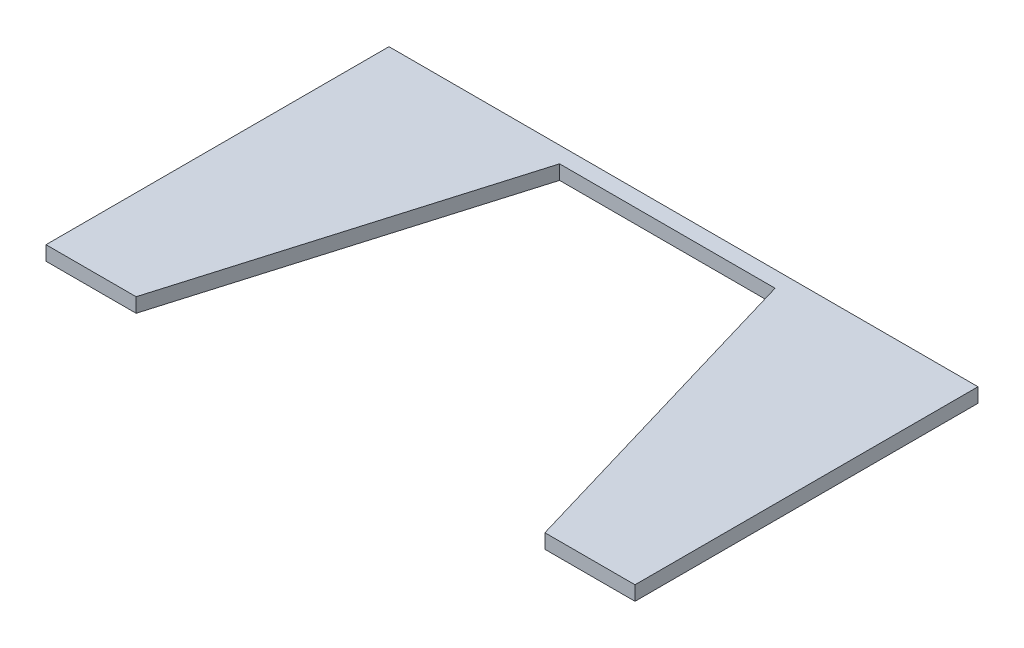
ISO-10303-21;
HEADER;
FILE_DESCRIPTION(('STEP AP214'),'2;1');
FILE_NAME('part.step','',(''),(''),'','','');
FILE_SCHEMA(('AUTOMOTIVE_DESIGN { 1 0 10303 214 1 1 1 1 }'));
ENDSEC;
DATA;
#1=APPLICATION_CONTEXT('core data for automotive mechanical design processes');
#2=APPLICATION_PROTOCOL_DEFINITION('international standard','automotive_design',2000,#1);
#3=PRODUCT_CONTEXT('',#1,'mechanical');
#4=PRODUCT('Part','Part','',(#3));
#5=PRODUCT_RELATED_PRODUCT_CATEGORY('part','',(#4));
#6=PRODUCT_DEFINITION_FORMATION('','',#4);
#7=PRODUCT_DEFINITION_CONTEXT('part definition',#1,'design');
#8=PRODUCT_DEFINITION('design','',#6,#7);
#9=PRODUCT_DEFINITION_SHAPE('','',#8);
#10=(LENGTH_UNIT() NAMED_UNIT(*) SI_UNIT(.MILLI.,.METRE.));
#11=(NAMED_UNIT(*) PLANE_ANGLE_UNIT() SI_UNIT($,.RADIAN.));
#12=(NAMED_UNIT(*) SI_UNIT($,.STERADIAN.) SOLID_ANGLE_UNIT());
#13=UNCERTAINTY_MEASURE_WITH_UNIT(LENGTH_MEASURE(1.E-05),#10,'distance_accuracy_value','');
#14=(GEOMETRIC_REPRESENTATION_CONTEXT(3) GLOBAL_UNCERTAINTY_ASSIGNED_CONTEXT((#13)) GLOBAL_UNIT_ASSIGNED_CONTEXT((#10,
#11,#12)) REPRESENTATION_CONTEXT('',''));
#15=CARTESIAN_POINT('',(0.,0.,0.));
#16=DIRECTION('',(0.,0.,1.));
#17=DIRECTION('',(1.,0.,0.));
#18=AXIS2_PLACEMENT_3D('',#15,#16,#17);
#19=CARTESIAN_POINT('',(0.,4.,-1.00000000000005));
#20=DIRECTION('',(0.,0.,1.));
#21=DIRECTION('',(1.,0.,0.));
#22=AXIS2_PLACEMENT_3D('',#19,#20,#21);
#23=PLANE('',#22);
#24=DIRECTION('',(-1.,0.,0.));
#25=VECTOR('',#24,1.);
#26=CARTESIAN_POINT('',(0.,0.,-1.00000000000005));
#27=LINE('',#26,#25);
#28=CARTESIAN_POINT('',(29.9999999999999,0.,-1.00000000000005));
#29=VERTEX_POINT('',#28);
#30=CARTESIAN_POINT('',(-30.0000000000001,0.,-1.00000000000005));
#31=VERTEX_POINT('',#30);
#32=EDGE_CURVE('E172',#29,#31,#27,.T.);
#33=ORIENTED_EDGE('',*,*,#32,.F.);
#34=DIRECTION('',(0.,-1.,0.));
#35=VECTOR('',#34,1.);
#36=CARTESIAN_POINT('',(29.9999999999999,4.,-1.00000000000005));
#37=LINE('',#36,#35);
#38=CARTESIAN_POINT('',(29.9999999999999,4.,-1.00000000000005));
#39=VERTEX_POINT('',#38);
#40=EDGE_CURVE('E11',#39,#29,#37,.T.);
#41=ORIENTED_EDGE('',*,*,#40,.F.);
#42=DIRECTION('',(-1.,0.,0.));
#43=VECTOR('',#42,1.);
#44=CARTESIAN_POINT('',(0.,4.,-1.00000000000005));
#45=LINE('',#44,#43);
#46=CARTESIAN_POINT('',(-30.0000000000001,4.,-1.00000000000005));
#47=VERTEX_POINT('',#46);
#48=EDGE_CURVE('E140',#39,#47,#45,.T.);
#49=ORIENTED_EDGE('',*,*,#48,.T.);
#50=DIRECTION('',(0.,-1.,0.));
#51=VECTOR('',#50,1.);
#52=CARTESIAN_POINT('',(-30.0000000000001,4.,-1.00000000000005));
#53=LINE('',#52,#51);
#54=EDGE_CURVE('E55',#47,#31,#53,.T.);
#55=ORIENTED_EDGE('',*,*,#54,.T.);
#56=EDGE_LOOP('',(#33,#41,#49,#55));
#57=FACE_BOUND('',#56,.T.);
#58=ADVANCED_FACE('F39',(#57),#23,.T.);
#59=CARTESIAN_POINT('',(27.8597060152573,4.,-8.23808511203847));
#60=DIRECTION('',(-0.958954003395283,0.,0.283561667670648));
#61=DIRECTION('',(0.283561667670648,0.,0.958954003395283));
#62=AXIS2_PLACEMENT_3D('',#59,#60,#61);
#63=PLANE('',#62);
#64=DIRECTION('',(-0.283561667670648,0.,-0.958954003395283));
#65=VECTOR('',#64,1.);
#66=CARTESIAN_POINT('',(27.8597060152573,0.,-8.23808511203847));
#67=LINE('',#66,#65);
#68=CARTESIAN_POINT('',(56.9086021505375,0.,89.9999999999999));
#69=VERTEX_POINT('',#68);
#70=EDGE_CURVE('E167',#69,#29,#67,.T.);
#71=ORIENTED_EDGE('',*,*,#70,.F.);
#72=DIRECTION('',(0.,-1.,0.));
#73=VECTOR('',#72,1.);
#74=CARTESIAN_POINT('',(56.9086021505375,4.,89.9999999999999));
#75=LINE('',#74,#73);
#76=CARTESIAN_POINT('',(56.9086021505375,4.,89.9999999999999));
#77=VERTEX_POINT('',#76);
#78=EDGE_CURVE('E47',#77,#69,#75,.T.);
#79=ORIENTED_EDGE('',*,*,#78,.F.);
#80=DIRECTION('',(-0.283561667670648,0.,-0.958954003395283));
#81=VECTOR('',#80,1.);
#82=CARTESIAN_POINT('',(27.8597060152573,4.,-8.23808511203847));
#83=LINE('',#82,#81);
#84=EDGE_CURVE('E134',#77,#39,#83,.T.);
#85=ORIENTED_EDGE('',*,*,#84,.T.);
#86=ORIENTED_EDGE('',*,*,#40,.T.);
#87=EDGE_LOOP('',(#71,#79,#85,#86));
#88=FACE_BOUND('',#87,.T.);
#89=ADVANCED_FACE('F171',(#88),#63,.T.);
#90=CARTESIAN_POINT('',(0.,4.,89.9999999999999));
#91=DIRECTION('',(0.,0.,-1.));
#92=DIRECTION('',(-1.,0.,0.));
#93=AXIS2_PLACEMENT_3D('',#90,#91,#92);
#94=PLANE('',#93);
#95=DIRECTION('',(1.,0.,0.));
#96=VECTOR('',#95,1.);
#97=CARTESIAN_POINT('',(0.,0.,89.9999999999999));
#98=LINE('',#97,#96);
#99=CARTESIAN_POINT('',(81.9999999999999,0.,89.9999999999999));
#100=VERTEX_POINT('',#99);
#101=EDGE_CURVE('E149',#69,#100,#98,.T.);
#102=ORIENTED_EDGE('',*,*,#101,.T.);
#103=DIRECTION('',(0.,-1.,0.));
#104=VECTOR('',#103,1.);
#105=CARTESIAN_POINT('',(81.9999999999999,4.,89.9999999999999));
#106=LINE('',#105,#104);
#107=CARTESIAN_POINT('',(81.9999999999999,4.,89.9999999999999));
#108=VERTEX_POINT('',#107);
#109=EDGE_CURVE('E158',#108,#100,#106,.T.);
#110=ORIENTED_EDGE('',*,*,#109,.F.);
#111=DIRECTION('',(1.,0.,0.));
#112=VECTOR('',#111,1.);
#113=CARTESIAN_POINT('',(0.,4.,89.9999999999999));
#114=LINE('',#113,#112);
#115=EDGE_CURVE('E129',#77,#108,#114,.T.);
#116=ORIENTED_EDGE('',*,*,#115,.F.);
#117=ORIENTED_EDGE('',*,*,#78,.T.);
#118=EDGE_LOOP('',(#102,#110,#116,#117));
#119=FACE_BOUND('',#118,.T.);
#120=ADVANCED_FACE('F162',(#119),#94,.F.);
#121=CARTESIAN_POINT('',(81.9999999999999,4.,0.));
#122=DIRECTION('',(1.,0.,0.));
#123=DIRECTION('',(0.,0.,-1.));
#124=AXIS2_PLACEMENT_3D('',#121,#122,#123);
#125=PLANE('',#124);
#126=DIRECTION('',(0.,0.,1.));
#127=VECTOR('',#126,1.);
#128=CARTESIAN_POINT('',(81.9999999999999,0.,0.));
#129=LINE('',#128,#127);
#130=CARTESIAN_POINT('',(81.9999999999999,0.,-5.50000000000008));
#131=VERTEX_POINT('',#130);
#132=EDGE_CURVE('E170',#131,#100,#129,.T.);
#133=ORIENTED_EDGE('',*,*,#132,.F.);
#134=DIRECTION('',(0.,-1.,0.));
#135=VECTOR('',#134,1.);
#136=CARTESIAN_POINT('',(81.9999999999999,4.,-5.50000000000008));
#137=LINE('',#136,#135);
#138=CARTESIAN_POINT('',(81.9999999999999,4.,-5.50000000000008));
#139=VERTEX_POINT('',#138);
#140=EDGE_CURVE('E156',#139,#131,#137,.T.);
#141=ORIENTED_EDGE('',*,*,#140,.F.);
#142=DIRECTION('',(0.,0.,1.));
#143=VECTOR('',#142,1.);
#144=CARTESIAN_POINT('',(81.9999999999999,4.,0.));
#145=LINE('',#144,#143);
#146=EDGE_CURVE('E133',#139,#108,#145,.T.);
#147=ORIENTED_EDGE('',*,*,#146,.T.);
#148=ORIENTED_EDGE('',*,*,#109,.T.);
#149=EDGE_LOOP('',(#133,#141,#147,#148));
#150=FACE_BOUND('',#149,.T.);
#151=ADVANCED_FACE('F181',(#150),#125,.T.);
#152=CARTESIAN_POINT('',(0.,4.,-5.50000000000007));
#153=DIRECTION('',(0.,0.,-1.));
#154=DIRECTION('',(-1.,0.,0.));
#155=AXIS2_PLACEMENT_3D('',#152,#153,#154);
#156=PLANE('',#155);
#157=DIRECTION('',(1.,0.,0.));
#158=VECTOR('',#157,1.);
#159=CARTESIAN_POINT('',(0.,0.,-5.50000000000007));
#160=LINE('',#159,#158);
#161=CARTESIAN_POINT('',(-82.0000000000001,0.,-5.50000000000006));
#162=VERTEX_POINT('',#161);
#163=EDGE_CURVE('E176',#162,#131,#160,.T.);
#164=ORIENTED_EDGE('',*,*,#163,.F.);
#165=DIRECTION('',(0.,-1.,0.));
#166=VECTOR('',#165,1.);
#167=CARTESIAN_POINT('',(-82.0000000000001,4.,-5.50000000000006));
#168=LINE('',#167,#166);
#169=CARTESIAN_POINT('',(-82.0000000000001,4.,-5.50000000000006));
#170=VERTEX_POINT('',#169);
#171=EDGE_CURVE('E124',#170,#162,#168,.T.);
#172=ORIENTED_EDGE('',*,*,#171,.F.);
#173=DIRECTION('',(1.,0.,0.));
#174=VECTOR('',#173,1.);
#175=CARTESIAN_POINT('',(0.,4.,-5.50000000000007));
#176=LINE('',#175,#174);
#177=EDGE_CURVE('E114',#170,#139,#176,.T.);
#178=ORIENTED_EDGE('',*,*,#177,.T.);
#179=ORIENTED_EDGE('',*,*,#140,.T.);
#180=EDGE_LOOP('',(#164,#172,#178,#179));
#181=FACE_BOUND('',#180,.T.);
#182=ADVANCED_FACE('F179',(#181),#156,.T.);
#183=CARTESIAN_POINT('',(-82.0000000000001,4.,0.));
#184=DIRECTION('',(1.,0.,0.));
#185=DIRECTION('',(0.,0.,-1.));
#186=AXIS2_PLACEMENT_3D('',#183,#184,#185);
#187=PLANE('',#186);
#188=DIRECTION('',(0.,0.,1.));
#189=VECTOR('',#188,1.);
#190=CARTESIAN_POINT('',(-82.0000000000001,0.,0.));
#191=LINE('',#190,#189);
#192=CARTESIAN_POINT('',(-82.0000000000001,0.,89.9999999999999));
#193=VERTEX_POINT('',#192);
#194=EDGE_CURVE('E121',#162,#193,#191,.T.);
#195=ORIENTED_EDGE('',*,*,#194,.T.);
#196=DIRECTION('',(0.,-1.,0.));
#197=VECTOR('',#196,1.);
#198=CARTESIAN_POINT('',(-82.0000000000001,4.,89.9999999999999));
#199=LINE('',#198,#197);
#200=CARTESIAN_POINT('',(-82.0000000000001,4.,89.9999999999999));
#201=VERTEX_POINT('',#200);
#202=EDGE_CURVE('E118',#201,#193,#199,.T.);
#203=ORIENTED_EDGE('',*,*,#202,.F.);
#204=DIRECTION('',(0.,0.,1.));
#205=VECTOR('',#204,1.);
#206=CARTESIAN_POINT('',(-82.0000000000001,4.,0.));
#207=LINE('',#206,#205);
#208=EDGE_CURVE('E106',#170,#201,#207,.T.);
#209=ORIENTED_EDGE('',*,*,#208,.F.);
#210=ORIENTED_EDGE('',*,*,#171,.T.);
#211=EDGE_LOOP('',(#195,#203,#209,#210));
#212=FACE_BOUND('',#211,.T.);
#213=ADVANCED_FACE('F119',(#212),#187,.F.);
#214=CARTESIAN_POINT('',(-56.9086021505377,0.,89.9999999999999));
#215=VERTEX_POINT('',#214);
#216=EDGE_CURVE('E145',#193,#215,#98,.T.);
#217=ORIENTED_EDGE('',*,*,#216,.T.);
#218=DIRECTION('',(0.,-1.,0.));
#219=VECTOR('',#218,1.);
#220=CARTESIAN_POINT('',(-56.9086021505377,4.,89.9999999999999));
#221=LINE('',#220,#219);
#222=CARTESIAN_POINT('',(-56.9086021505377,4.,89.9999999999999));
#223=VERTEX_POINT('',#222);
#224=EDGE_CURVE('E81',#223,#215,#221,.T.);
#225=ORIENTED_EDGE('',*,*,#224,.F.);
#226=EDGE_CURVE('E111',#201,#223,#114,.T.);
#227=ORIENTED_EDGE('',*,*,#226,.F.);
#228=ORIENTED_EDGE('',*,*,#202,.T.);
#229=EDGE_LOOP('',(#217,#225,#227,#228));
#230=FACE_BOUND('',#229,.T.);
#231=ADVANCED_FACE('F126',(#230),#94,.F.);
#232=CARTESIAN_POINT('',(-27.8597060152575,4.,-8.23808511203852));
#233=DIRECTION('',(0.958954003395283,0.,0.283561667670648));
#234=DIRECTION('',(0.283561667670648,0.,-0.958954003395283));
#235=AXIS2_PLACEMENT_3D('',#232,#233,#234);
#236=PLANE('',#235);
#237=DIRECTION('',(-0.283561667670648,0.,0.958954003395283));
#238=VECTOR('',#237,1.);
#239=CARTESIAN_POINT('',(-27.8597060152575,0.,-8.23808511203852));
#240=LINE('',#239,#238);
#241=EDGE_CURVE('E142',#31,#215,#240,.T.);
#242=ORIENTED_EDGE('',*,*,#241,.F.);
#243=ORIENTED_EDGE('',*,*,#54,.F.);
#244=DIRECTION('',(-0.283561667670648,0.,0.958954003395283));
#245=VECTOR('',#244,1.);
#246=CARTESIAN_POINT('',(-27.8597060152575,4.,-8.23808511203852));
#247=LINE('',#246,#245);
#248=EDGE_CURVE('E127',#47,#223,#247,.T.);
#249=ORIENTED_EDGE('',*,*,#248,.T.);
#250=ORIENTED_EDGE('',*,*,#224,.T.);
#251=EDGE_LOOP('',(#242,#243,#249,#250));
#252=FACE_BOUND('',#251,.T.);
#253=ADVANCED_FACE('F194',(#252),#236,.T.);
#254=CARTESIAN_POINT('',(0.,4.,0.));
#255=DIRECTION('',(0.,1.,0.));
#256=DIRECTION('',(0.,0.,1.));
#257=AXIS2_PLACEMENT_3D('',#254,#255,#256);
#258=PLANE('',#257);
#259=ORIENTED_EDGE('',*,*,#48,.F.);
#260=ORIENTED_EDGE('',*,*,#84,.F.);
#261=ORIENTED_EDGE('',*,*,#115,.T.);
#262=ORIENTED_EDGE('',*,*,#146,.F.);
#263=ORIENTED_EDGE('',*,*,#177,.F.);
#264=ORIENTED_EDGE('',*,*,#208,.T.);
#265=ORIENTED_EDGE('',*,*,#226,.T.);
#266=ORIENTED_EDGE('',*,*,#248,.F.);
#267=EDGE_LOOP('',(#259,#260,#261,#262,#263,#264,#265,#266));
#268=FACE_BOUND('',#267,.T.);
#269=ADVANCED_FACE('F108',(#268),#258,.T.);
#270=CARTESIAN_POINT('',(0.,0.,0.));
#271=DIRECTION('',(0.,1.,0.));
#272=DIRECTION('',(0.,0.,1.));
#273=AXIS2_PLACEMENT_3D('',#270,#271,#272);
#274=PLANE('',#273);
#275=ORIENTED_EDGE('',*,*,#32,.T.);
#276=ORIENTED_EDGE('',*,*,#241,.T.);
#277=ORIENTED_EDGE('',*,*,#216,.F.);
#278=ORIENTED_EDGE('',*,*,#194,.F.);
#279=ORIENTED_EDGE('',*,*,#163,.T.);
#280=ORIENTED_EDGE('',*,*,#132,.T.);
#281=ORIENTED_EDGE('',*,*,#101,.F.);
#282=ORIENTED_EDGE('',*,*,#70,.T.);
#283=EDGE_LOOP('',(#275,#276,#277,#278,#279,#280,#281,#282));
#284=FACE_BOUND('',#283,.T.);
#285=ADVANCED_FACE('F166',(#284),#274,.F.);
#286=CLOSED_SHELL('',(#58,#89,#120,#151,#182,#213,#231,#253,#269,#285));
#287=MANIFOLD_SOLID_BREP('B2',#286);
#288=ADVANCED_BREP_SHAPE_REPRESENTATION('',(#18,#287),#14);
#289=SHAPE_DEFINITION_REPRESENTATION(#9,#288);
ENDSEC;
END-ISO-10303-21;
